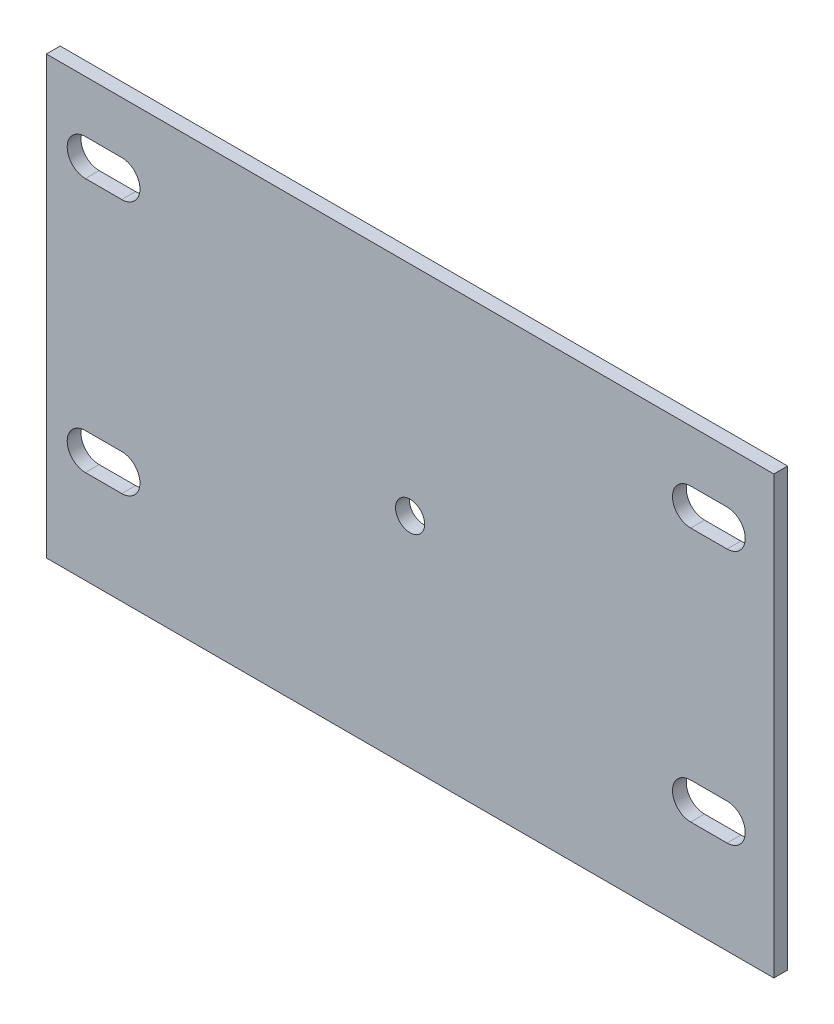
ISO-10303-21;
HEADER;
FILE_DESCRIPTION(('STEP AP214'),'2;1');
FILE_NAME('part.step','',(''),(''),'','','');
FILE_SCHEMA(('AUTOMOTIVE_DESIGN { 1 0 10303 214 1 1 1 1 }'));
ENDSEC;
DATA;
#1=APPLICATION_CONTEXT('core data for automotive mechanical design processes');
#2=APPLICATION_PROTOCOL_DEFINITION('international standard','automotive_design',2000,#1);
#3=PRODUCT_CONTEXT('',#1,'mechanical');
#4=PRODUCT('Part','Part','',(#3));
#5=PRODUCT_RELATED_PRODUCT_CATEGORY('part','',(#4));
#6=PRODUCT_DEFINITION_FORMATION('','',#4);
#7=PRODUCT_DEFINITION_CONTEXT('part definition',#1,'design');
#8=PRODUCT_DEFINITION('design','',#6,#7);
#9=PRODUCT_DEFINITION_SHAPE('','',#8);
#10=(LENGTH_UNIT() NAMED_UNIT(*) SI_UNIT(.MILLI.,.METRE.));
#11=(NAMED_UNIT(*) PLANE_ANGLE_UNIT() SI_UNIT($,.RADIAN.));
#12=(NAMED_UNIT(*) SI_UNIT($,.STERADIAN.) SOLID_ANGLE_UNIT());
#13=UNCERTAINTY_MEASURE_WITH_UNIT(LENGTH_MEASURE(1.E-05),#10,'distance_accuracy_value','');
#14=(GEOMETRIC_REPRESENTATION_CONTEXT(3) GLOBAL_UNCERTAINTY_ASSIGNED_CONTEXT((#13)) GLOBAL_UNIT_ASSIGNED_CONTEXT((#10,
#11,#12)) REPRESENTATION_CONTEXT('',''));
#15=CARTESIAN_POINT('',(0.,0.,0.));
#16=DIRECTION('',(0.,0.,1.));
#17=DIRECTION('',(1.,0.,0.));
#18=AXIS2_PLACEMENT_3D('',#15,#16,#17);
#19=CARTESIAN_POINT('',(-66.0086980920406,33.0866668623942,-1.89738));
#20=DIRECTION('',(-1.,0.,0.));
#21=DIRECTION('',(0.,0.,1.));
#22=AXIS2_PLACEMENT_3D('',#19,#20,#21);
#23=PLANE('',#22);
#24=DIRECTION('',(0.,-1.,0.));
#25=VECTOR('',#24,1.);
#26=CARTESIAN_POINT('',(-66.0086980920406,33.0866668623942,0.));
#27=LINE('',#26,#25);
#28=CARTESIAN_POINT('',(-66.0086980920406,33.0866668623942,0.));
#29=VERTEX_POINT('',#28);
#30=CARTESIAN_POINT('',(-66.0086980920406,-26.9133331376058,0.));
#31=VERTEX_POINT('',#30);
#32=EDGE_CURVE('E307',#29,#31,#27,.T.);
#33=ORIENTED_EDGE('',*,*,#32,.F.);
#34=DIRECTION('',(0.,0.,1.));
#35=VECTOR('',#34,1.);
#36=CARTESIAN_POINT('',(-66.0086980920406,33.0866668623942,-1.89738));
#37=LINE('',#36,#35);
#38=CARTESIAN_POINT('',(-66.0086980920406,33.0866668623942,-1.89738));
#39=VERTEX_POINT('',#38);
#40=EDGE_CURVE('E11',#39,#29,#37,.T.);
#41=ORIENTED_EDGE('',*,*,#40,.F.);
#42=DIRECTION('',(0.,-1.,0.));
#43=VECTOR('',#42,1.);
#44=CARTESIAN_POINT('',(-66.0086980920406,33.0866668623942,-1.89738));
#45=LINE('',#44,#43);
#46=CARTESIAN_POINT('',(-66.0086980920406,-26.9133331376058,-1.89738));
#47=VERTEX_POINT('',#46);
#48=EDGE_CURVE('E308',#39,#47,#45,.T.);
#49=ORIENTED_EDGE('',*,*,#48,.T.);
#50=DIRECTION('',(0.,0.,1.));
#51=VECTOR('',#50,1.);
#52=CARTESIAN_POINT('',(-66.0086980920406,-26.9133331376058,-1.89738));
#53=LINE('',#52,#51);
#54=EDGE_CURVE('E40',#47,#31,#53,.T.);
#55=ORIENTED_EDGE('',*,*,#54,.T.);
#56=EDGE_LOOP('',(#33,#41,#49,#55));
#57=FACE_BOUND('',#56,.T.);
#58=ADVANCED_FACE('F37',(#57),#23,.T.);
#59=CARTESIAN_POINT('',(-66.0086980920406,33.0866668623942,-1.89738));
#60=DIRECTION('',(0.,1.,0.));
#61=DIRECTION('',(0.,0.,1.));
#62=AXIS2_PLACEMENT_3D('',#59,#60,#61);
#63=PLANE('',#62);
#64=DIRECTION('',(-1.,0.,0.));
#65=VECTOR('',#64,1.);
#66=CARTESIAN_POINT('',(-66.0086980920406,33.0866668623942,0.));
#67=LINE('',#66,#65);
#68=CARTESIAN_POINT('',(33.9913019079594,33.0866668623942,0.));
#69=VERTEX_POINT('',#68);
#70=EDGE_CURVE('E312',#69,#29,#67,.T.);
#71=ORIENTED_EDGE('',*,*,#70,.F.);
#72=DIRECTION('',(0.,0.,1.));
#73=VECTOR('',#72,1.);
#74=CARTESIAN_POINT('',(33.9913019079594,33.0866668623942,-1.89738));
#75=LINE('',#74,#73);
#76=CARTESIAN_POINT('',(33.9913019079594,33.0866668623942,-1.89738));
#77=VERTEX_POINT('',#76);
#78=EDGE_CURVE('E45',#77,#69,#75,.T.);
#79=ORIENTED_EDGE('',*,*,#78,.F.);
#80=DIRECTION('',(-1.,0.,0.));
#81=VECTOR('',#80,1.);
#82=CARTESIAN_POINT('',(-66.0086980920406,33.0866668623942,-1.89738));
#83=LINE('',#82,#81);
#84=EDGE_CURVE('E318',#77,#39,#83,.T.);
#85=ORIENTED_EDGE('',*,*,#84,.T.);
#86=ORIENTED_EDGE('',*,*,#40,.T.);
#87=EDGE_LOOP('',(#71,#79,#85,#86));
#88=FACE_BOUND('',#87,.T.);
#89=ADVANCED_FACE('F343',(#88),#63,.T.);
#90=CARTESIAN_POINT('',(33.9913019079594,33.0866668623942,-1.89738));
#91=DIRECTION('',(1.,0.,0.));
#92=DIRECTION('',(0.,0.,-1.));
#93=AXIS2_PLACEMENT_3D('',#90,#91,#92);
#94=PLANE('',#93);
#95=DIRECTION('',(0.,1.,0.));
#96=VECTOR('',#95,1.);
#97=CARTESIAN_POINT('',(33.9913019079594,33.0866668623942,0.));
#98=LINE('',#97,#96);
#99=CARTESIAN_POINT('',(33.9913019079594,-26.9133331376058,0.));
#100=VERTEX_POINT('',#99);
#101=EDGE_CURVE('E326',#100,#69,#98,.T.);
#102=ORIENTED_EDGE('',*,*,#101,.F.);
#103=DIRECTION('',(0.,0.,1.));
#104=VECTOR('',#103,1.);
#105=CARTESIAN_POINT('',(33.9913019079594,-26.9133331376058,-1.89738));
#106=LINE('',#105,#104);
#107=CARTESIAN_POINT('',(33.9913019079594,-26.9133331376058,-1.89738));
#108=VERTEX_POINT('',#107);
#109=EDGE_CURVE('E331',#108,#100,#106,.T.);
#110=ORIENTED_EDGE('',*,*,#109,.F.);
#111=DIRECTION('',(0.,1.,0.));
#112=VECTOR('',#111,1.);
#113=CARTESIAN_POINT('',(33.9913019079594,33.0866668623942,-1.89738));
#114=LINE('',#113,#112);
#115=EDGE_CURVE('E315',#108,#77,#114,.T.);
#116=ORIENTED_EDGE('',*,*,#115,.T.);
#117=ORIENTED_EDGE('',*,*,#78,.T.);
#118=EDGE_LOOP('',(#102,#110,#116,#117));
#119=FACE_BOUND('',#118,.T.);
#120=ADVANCED_FACE('F349',(#119),#94,.T.);
#121=CARTESIAN_POINT('',(-66.0086980920406,-26.9133331376058,-1.89738));
#122=DIRECTION('',(0.,-1.,0.));
#123=DIRECTION('',(0.,0.,-1.));
#124=AXIS2_PLACEMENT_3D('',#121,#122,#123);
#125=PLANE('',#124);
#126=DIRECTION('',(1.,0.,0.));
#127=VECTOR('',#126,1.);
#128=CARTESIAN_POINT('',(-66.0086980920406,-26.9133331376058,0.));
#129=LINE('',#128,#127);
#130=EDGE_CURVE('E323',#31,#100,#129,.T.);
#131=ORIENTED_EDGE('',*,*,#130,.F.);
#132=ORIENTED_EDGE('',*,*,#54,.F.);
#133=DIRECTION('',(1.,0.,0.));
#134=VECTOR('',#133,1.);
#135=CARTESIAN_POINT('',(-66.0086980920406,-26.9133331376058,-1.89738));
#136=LINE('',#135,#134);
#137=EDGE_CURVE('E311',#47,#108,#136,.T.);
#138=ORIENTED_EDGE('',*,*,#137,.T.);
#139=ORIENTED_EDGE('',*,*,#109,.T.);
#140=EDGE_LOOP('',(#131,#132,#138,#139));
#141=FACE_BOUND('',#140,.T.);
#142=ADVANCED_FACE('F339',(#141),#125,.T.);
#143=CARTESIAN_POINT('',(0.,0.,-1.89738));
#144=DIRECTION('',(0.,0.,1.));
#145=DIRECTION('',(1.,0.,0.));
#146=AXIS2_PLACEMENT_3D('',#143,#144,#145);
#147=PLANE('',#146);
#148=CARTESIAN_POINT('',(-16.0086980920406,3.08666686239417,-1.89738));
#149=DIRECTION('',(0.,0.,1.));
#150=DIRECTION('',(1.,0.,0.));
#151=AXIS2_PLACEMENT_3D('',#148,#149,#150);
#152=CIRCLE('',#151,2.);
#153=CARTESIAN_POINT('',(-14.0086980920406,3.08666686239417,-1.89738));
#154=VERTEX_POINT('',#153);
#155=EDGE_CURVE('E615',#154,#154,#152,.T.);
#156=ORIENTED_EDGE('',*,*,#155,.T.);
#157=EDGE_LOOP('',(#156));
#158=FACE_BOUND('',#157,.T.);
#159=DIRECTION('',(1.,0.,0.));
#160=VECTOR('',#159,1.);
#161=CARTESIAN_POINT('',(0.,-14.0611849792509,-1.89738));
#162=LINE('',#161,#160);
#163=CARTESIAN_POINT('',(22.5608827371854,-14.0611849792509,-1.89738));
#164=VERTEX_POINT('',#163);
#165=CARTESIAN_POINT('',(27.5608827371854,-14.0611849792509,-1.89738));
#166=VERTEX_POINT('',#165);
#167=EDGE_CURVE('E205',#164,#166,#162,.T.);
#168=ORIENTED_EDGE('',*,*,#167,.T.);
#169=CARTESIAN_POINT('',(27.5608827371854,-11.5611849792509,-1.89738));
#170=DIRECTION('',(0.,0.,1.));
#171=DIRECTION('',(1.,0.,0.));
#172=AXIS2_PLACEMENT_3D('',#169,#170,#171);
#173=CIRCLE('',#172,2.5);
#174=CARTESIAN_POINT('',(27.5608827371854,-9.06118497925086,-1.89738));
#175=VERTEX_POINT('',#174);
#176=EDGE_CURVE('E208',#166,#175,#173,.T.);
#177=ORIENTED_EDGE('',*,*,#176,.T.);
#178=DIRECTION('',(-1.,0.,0.));
#179=VECTOR('',#178,1.);
#180=CARTESIAN_POINT('',(0.,-9.06118497925087,-1.89738));
#181=LINE('',#180,#179);
#182=CARTESIAN_POINT('',(22.5608827371854,-9.06118497925086,-1.89738));
#183=VERTEX_POINT('',#182);
#184=EDGE_CURVE('E200',#175,#183,#181,.T.);
#185=ORIENTED_EDGE('',*,*,#184,.T.);
#186=CARTESIAN_POINT('',(22.5608827371854,-11.5611849792509,-1.89738));
#187=DIRECTION('',(0.,0.,1.));
#188=DIRECTION('',(1.,0.,0.));
#189=AXIS2_PLACEMENT_3D('',#186,#187,#188);
#190=CIRCLE('',#189,2.5);
#191=EDGE_CURVE('E180',#183,#164,#190,.T.);
#192=ORIENTED_EDGE('',*,*,#191,.T.);
#193=EDGE_LOOP('',(#168,#177,#185,#192));
#194=FACE_BOUND('',#193,.T.);
#195=DIRECTION('',(1.,0.,0.));
#196=VECTOR('',#195,1.);
#197=CARTESIAN_POINT('',(0.,20.9388150207494,-1.89738));
#198=LINE('',#197,#196);
#199=CARTESIAN_POINT('',(22.5608827371854,20.9388150207494,-1.89738));
#200=VERTEX_POINT('',#199);
#201=CARTESIAN_POINT('',(27.5608827371854,20.9388150207494,-1.89738));
#202=VERTEX_POINT('',#201);
#203=EDGE_CURVE('E237',#200,#202,#198,.T.);
#204=ORIENTED_EDGE('',*,*,#203,.T.);
#205=CARTESIAN_POINT('',(27.5608827371854,23.4388150207494,-1.89738));
#206=DIRECTION('',(0.,0.,1.));
#207=DIRECTION('',(1.,0.,0.));
#208=AXIS2_PLACEMENT_3D('',#205,#206,#207);
#209=CIRCLE('',#208,2.5);
#210=CARTESIAN_POINT('',(27.5608827371854,25.9388150207494,-1.89738));
#211=VERTEX_POINT('',#210);
#212=EDGE_CURVE('E240',#202,#211,#209,.T.);
#213=ORIENTED_EDGE('',*,*,#212,.T.);
#214=DIRECTION('',(-1.,0.,0.));
#215=VECTOR('',#214,1.);
#216=CARTESIAN_POINT('',(0.,25.9388150207494,-1.89738));
#217=LINE('',#216,#215);
#218=CARTESIAN_POINT('',(22.5608827371854,25.9388150207494,-1.89738));
#219=VERTEX_POINT('',#218);
#220=EDGE_CURVE('E225',#211,#219,#217,.T.);
#221=ORIENTED_EDGE('',*,*,#220,.T.);
#222=CARTESIAN_POINT('',(22.5608827371854,23.4388150207494,-1.89738));
#223=DIRECTION('',(0.,0.,1.));
#224=DIRECTION('',(1.,0.,0.));
#225=AXIS2_PLACEMENT_3D('',#222,#223,#224);
#226=CIRCLE('',#225,2.5);
#227=EDGE_CURVE('E234',#219,#200,#226,.T.);
#228=ORIENTED_EDGE('',*,*,#227,.T.);
#229=EDGE_LOOP('',(#204,#213,#221,#228));
#230=FACE_BOUND('',#229,.T.);
#231=DIRECTION('',(-1.,0.,0.));
#232=VECTOR('',#231,1.);
#233=CARTESIAN_POINT('',(0.,25.9388150207494,-1.89738));
#234=LINE('',#233,#232);
#235=CARTESIAN_POINT('',(-55.6443572628158,25.9388150207494,-1.89738));
#236=VERTEX_POINT('',#235);
#237=CARTESIAN_POINT('',(-60.6443572628158,25.9388150207494,-1.89738));
#238=VERTEX_POINT('',#237);
#239=EDGE_CURVE('E269',#236,#238,#234,.T.);
#240=ORIENTED_EDGE('',*,*,#239,.T.);
#241=CARTESIAN_POINT('',(-60.6443572628158,23.4388150207494,-1.89738));
#242=DIRECTION('',(0.,0.,1.));
#243=DIRECTION('',(1.,0.,0.));
#244=AXIS2_PLACEMENT_3D('',#241,#242,#243);
#245=CIRCLE('',#244,2.5);
#246=CARTESIAN_POINT('',(-60.6443572628158,20.9388150207494,-1.89738));
#247=VERTEX_POINT('',#246);
#248=EDGE_CURVE('E272',#238,#247,#245,.T.);
#249=ORIENTED_EDGE('',*,*,#248,.T.);
#250=DIRECTION('',(1.,0.,0.));
#251=VECTOR('',#250,1.);
#252=CARTESIAN_POINT('',(0.,20.9388150207494,-1.89738));
#253=LINE('',#252,#251);
#254=CARTESIAN_POINT('',(-55.6443572628158,20.9388150207494,-1.89738));
#255=VERTEX_POINT('',#254);
#256=EDGE_CURVE('E257',#247,#255,#253,.T.);
#257=ORIENTED_EDGE('',*,*,#256,.T.);
#258=CARTESIAN_POINT('',(-55.6443572628158,23.4388150207494,-1.89738));
#259=DIRECTION('',(0.,0.,1.));
#260=DIRECTION('',(1.,0.,0.));
#261=AXIS2_PLACEMENT_3D('',#258,#259,#260);
#262=CIRCLE('',#261,2.5);
#263=EDGE_CURVE('E266',#255,#236,#262,.T.);
#264=ORIENTED_EDGE('',*,*,#263,.T.);
#265=EDGE_LOOP('',(#240,#249,#257,#264));
#266=FACE_BOUND('',#265,.T.);
#267=DIRECTION('',(-1.,0.,0.));
#268=VECTOR('',#267,1.);
#269=CARTESIAN_POINT('',(0.,-9.06118497925084,-1.89738));
#270=LINE('',#269,#268);
#271=CARTESIAN_POINT('',(-55.6443572628158,-9.06118497925086,-1.89738));
#272=VERTEX_POINT('',#271);
#273=CARTESIAN_POINT('',(-60.6443572628158,-9.06118497925086,-1.89738));
#274=VERTEX_POINT('',#273);
#275=EDGE_CURVE('E301',#272,#274,#270,.T.);
#276=ORIENTED_EDGE('',*,*,#275,.T.);
#277=CARTESIAN_POINT('',(-60.6443572628158,-11.5611849792509,-1.89738));
#278=DIRECTION('',(0.,0.,1.));
#279=DIRECTION('',(1.,0.,0.));
#280=AXIS2_PLACEMENT_3D('',#277,#278,#279);
#281=CIRCLE('',#280,2.5);
#282=CARTESIAN_POINT('',(-60.6443572628158,-14.0611849792509,-1.89738));
#283=VERTEX_POINT('',#282);
#284=EDGE_CURVE('E304',#274,#283,#281,.T.);
#285=ORIENTED_EDGE('',*,*,#284,.T.);
#286=DIRECTION('',(1.,0.,0.));
#287=VECTOR('',#286,1.);
#288=CARTESIAN_POINT('',(0.,-14.0611849792508,-1.89738));
#289=LINE('',#288,#287);
#290=CARTESIAN_POINT('',(-55.6443572628158,-14.0611849792509,-1.89738));
#291=VERTEX_POINT('',#290);
#292=EDGE_CURVE('E289',#283,#291,#289,.T.);
#293=ORIENTED_EDGE('',*,*,#292,.T.);
#294=CARTESIAN_POINT('',(-55.6443572628158,-11.5611849792509,-1.89738));
#295=DIRECTION('',(0.,0.,1.));
#296=DIRECTION('',(1.,0.,0.));
#297=AXIS2_PLACEMENT_3D('',#294,#295,#296);
#298=CIRCLE('',#297,2.5);
#299=EDGE_CURVE('E298',#291,#272,#298,.T.);
#300=ORIENTED_EDGE('',*,*,#299,.T.);
#301=EDGE_LOOP('',(#276,#285,#293,#300));
#302=FACE_BOUND('',#301,.T.);
#303=ORIENTED_EDGE('',*,*,#48,.F.);
#304=ORIENTED_EDGE('',*,*,#84,.F.);
#305=ORIENTED_EDGE('',*,*,#115,.F.);
#306=ORIENTED_EDGE('',*,*,#137,.F.);
#307=EDGE_LOOP('',(#303,#304,#305,#306));
#308=FACE_BOUND('',#307,.T.);
#309=ADVANCED_FACE('F346',(#158,#194,#230,#266,#302,#308),#147,.F.);
#310=CARTESIAN_POINT('',(0.,0.,0.));
#311=DIRECTION('',(0.,0.,1.));
#312=DIRECTION('',(1.,0.,0.));
#313=AXIS2_PLACEMENT_3D('',#310,#311,#312);
#314=PLANE('',#313);
#315=CARTESIAN_POINT('',(-16.0086980920406,3.08666686239417,0.));
#316=DIRECTION('',(0.,0.,1.));
#317=DIRECTION('',(1.,0.,0.));
#318=AXIS2_PLACEMENT_3D('',#315,#316,#317);
#319=CIRCLE('',#318,2.);
#320=CARTESIAN_POINT('',(-14.0086980920406,3.08666686239417,0.));
#321=VERTEX_POINT('',#320);
#322=EDGE_CURVE('E612',#321,#321,#319,.T.);
#323=ORIENTED_EDGE('',*,*,#322,.F.);
#324=EDGE_LOOP('',(#323));
#325=FACE_BOUND('',#324,.T.);
#326=CARTESIAN_POINT('',(27.5608827371854,-11.5611849792509,0.));
#327=DIRECTION('',(0.,0.,1.));
#328=DIRECTION('',(1.,0.,0.));
#329=AXIS2_PLACEMENT_3D('',#326,#327,#328);
#330=CIRCLE('',#329,2.5);
#331=CARTESIAN_POINT('',(27.5608827371854,-14.0611849792509,0.));
#332=VERTEX_POINT('',#331);
#333=CARTESIAN_POINT('',(27.5608827371854,-9.06118497925086,0.));
#334=VERTEX_POINT('',#333);
#335=EDGE_CURVE('E61',#332,#334,#330,.T.);
#336=ORIENTED_EDGE('',*,*,#335,.F.);
#337=DIRECTION('',(1.,0.,0.));
#338=VECTOR('',#337,1.);
#339=CARTESIAN_POINT('',(27.5608827371854,-14.0611849792509,0.));
#340=LINE('',#339,#338);
#341=CARTESIAN_POINT('',(22.5608827371854,-14.0611849792509,0.));
#342=VERTEX_POINT('',#341);
#343=EDGE_CURVE('E193',#342,#332,#340,.T.);
#344=ORIENTED_EDGE('',*,*,#343,.F.);
#345=CARTESIAN_POINT('',(22.5608827371854,-11.5611849792509,0.));
#346=DIRECTION('',(0.,0.,1.));
#347=DIRECTION('',(1.,0.,0.));
#348=AXIS2_PLACEMENT_3D('',#345,#346,#347);
#349=CIRCLE('',#348,2.5);
#350=CARTESIAN_POINT('',(22.5608827371854,-9.06118497925086,0.));
#351=VERTEX_POINT('',#350);
#352=EDGE_CURVE('E177',#351,#342,#349,.T.);
#353=ORIENTED_EDGE('',*,*,#352,.F.);
#354=DIRECTION('',(-1.,0.,0.));
#355=VECTOR('',#354,1.);
#356=CARTESIAN_POINT('',(27.5608827371854,-9.06118497925086,0.));
#357=LINE('',#356,#355);
#358=EDGE_CURVE('E186',#334,#351,#357,.T.);
#359=ORIENTED_EDGE('',*,*,#358,.F.);
#360=EDGE_LOOP('',(#336,#344,#353,#359));
#361=FACE_BOUND('',#360,.T.);
#362=CARTESIAN_POINT('',(27.5608827371854,23.4388150207494,0.));
#363=DIRECTION('',(0.,0.,1.));
#364=DIRECTION('',(1.,0.,0.));
#365=AXIS2_PLACEMENT_3D('',#362,#363,#364);
#366=CIRCLE('',#365,2.5);
#367=CARTESIAN_POINT('',(27.5608827371854,20.9388150207494,0.));
#368=VERTEX_POINT('',#367);
#369=CARTESIAN_POINT('',(27.5608827371854,25.9388150207494,0.));
#370=VERTEX_POINT('',#369);
#371=EDGE_CURVE('E211',#368,#370,#366,.T.);
#372=ORIENTED_EDGE('',*,*,#371,.F.);
#373=DIRECTION('',(1.,0.,0.));
#374=VECTOR('',#373,1.);
#375=CARTESIAN_POINT('',(27.5608827371854,20.9388150207494,0.));
#376=LINE('',#375,#374);
#377=CARTESIAN_POINT('',(22.5608827371854,20.9388150207494,0.));
#378=VERTEX_POINT('',#377);
#379=EDGE_CURVE('E219',#378,#368,#376,.T.);
#380=ORIENTED_EDGE('',*,*,#379,.F.);
#381=CARTESIAN_POINT('',(22.5608827371854,23.4388150207494,0.));
#382=DIRECTION('',(0.,0.,1.));
#383=DIRECTION('',(1.,0.,0.));
#384=AXIS2_PLACEMENT_3D('',#381,#382,#383);
#385=CIRCLE('',#384,2.5);
#386=CARTESIAN_POINT('',(22.5608827371854,25.9388150207494,0.));
#387=VERTEX_POINT('',#386);
#388=EDGE_CURVE('E216',#387,#378,#385,.T.);
#389=ORIENTED_EDGE('',*,*,#388,.F.);
#390=DIRECTION('',(-1.,0.,0.));
#391=VECTOR('',#390,1.);
#392=CARTESIAN_POINT('',(27.5608827371854,25.9388150207494,0.));
#393=LINE('',#392,#391);
#394=EDGE_CURVE('E213',#370,#387,#393,.T.);
#395=ORIENTED_EDGE('',*,*,#394,.F.);
#396=EDGE_LOOP('',(#372,#380,#389,#395));
#397=FACE_BOUND('',#396,.T.);
#398=CARTESIAN_POINT('',(-60.6443572628158,23.4388150207494,0.));
#399=DIRECTION('',(0.,0.,1.));
#400=DIRECTION('',(1.,0.,0.));
#401=AXIS2_PLACEMENT_3D('',#398,#399,#400);
#402=CIRCLE('',#401,2.5);
#403=CARTESIAN_POINT('',(-60.6443572628158,25.9388150207494,0.));
#404=VERTEX_POINT('',#403);
#405=CARTESIAN_POINT('',(-60.6443572628158,20.9388150207494,0.));
#406=VERTEX_POINT('',#405);
#407=EDGE_CURVE('E243',#404,#406,#402,.T.);
#408=ORIENTED_EDGE('',*,*,#407,.F.);
#409=DIRECTION('',(-1.,0.,0.));
#410=VECTOR('',#409,1.);
#411=CARTESIAN_POINT('',(-60.6443572628158,25.9388150207494,0.));
#412=LINE('',#411,#410);
#413=CARTESIAN_POINT('',(-55.6443572628158,25.9388150207494,0.));
#414=VERTEX_POINT('',#413);
#415=EDGE_CURVE('E251',#414,#404,#412,.T.);
#416=ORIENTED_EDGE('',*,*,#415,.F.);
#417=CARTESIAN_POINT('',(-55.6443572628158,23.4388150207494,0.));
#418=DIRECTION('',(0.,0.,1.));
#419=DIRECTION('',(1.,0.,0.));
#420=AXIS2_PLACEMENT_3D('',#417,#418,#419);
#421=CIRCLE('',#420,2.5);
#422=CARTESIAN_POINT('',(-55.6443572628158,20.9388150207494,0.));
#423=VERTEX_POINT('',#422);
#424=EDGE_CURVE('E248',#423,#414,#421,.T.);
#425=ORIENTED_EDGE('',*,*,#424,.F.);
#426=DIRECTION('',(1.,0.,0.));
#427=VECTOR('',#426,1.);
#428=CARTESIAN_POINT('',(-60.6443572628158,20.9388150207494,0.));
#429=LINE('',#428,#427);
#430=EDGE_CURVE('E245',#406,#423,#429,.T.);
#431=ORIENTED_EDGE('',*,*,#430,.F.);
#432=EDGE_LOOP('',(#408,#416,#425,#431));
#433=FACE_BOUND('',#432,.T.);
#434=CARTESIAN_POINT('',(-60.6443572628158,-11.5611849792509,0.));
#435=DIRECTION('',(0.,0.,1.));
#436=DIRECTION('',(1.,0.,0.));
#437=AXIS2_PLACEMENT_3D('',#434,#435,#436);
#438=CIRCLE('',#437,2.5);
#439=CARTESIAN_POINT('',(-60.6443572628158,-9.06118497925086,0.));
#440=VERTEX_POINT('',#439);
#441=CARTESIAN_POINT('',(-60.6443572628158,-14.0611849792509,0.));
#442=VERTEX_POINT('',#441);
#443=EDGE_CURVE('E275',#440,#442,#438,.T.);
#444=ORIENTED_EDGE('',*,*,#443,.F.);
#445=DIRECTION('',(-1.,0.,0.));
#446=VECTOR('',#445,1.);
#447=CARTESIAN_POINT('',(-60.6443572628158,-9.06118497925086,0.));
#448=LINE('',#447,#446);
#449=CARTESIAN_POINT('',(-55.6443572628158,-9.06118497925086,0.));
#450=VERTEX_POINT('',#449);
#451=EDGE_CURVE('E283',#450,#440,#448,.T.);
#452=ORIENTED_EDGE('',*,*,#451,.F.);
#453=CARTESIAN_POINT('',(-55.6443572628158,-11.5611849792509,0.));
#454=DIRECTION('',(0.,0.,1.));
#455=DIRECTION('',(1.,0.,0.));
#456=AXIS2_PLACEMENT_3D('',#453,#454,#455);
#457=CIRCLE('',#456,2.5);
#458=CARTESIAN_POINT('',(-55.6443572628158,-14.0611849792509,0.));
#459=VERTEX_POINT('',#458);
#460=EDGE_CURVE('E280',#459,#450,#457,.T.);
#461=ORIENTED_EDGE('',*,*,#460,.F.);
#462=DIRECTION('',(1.,0.,0.));
#463=VECTOR('',#462,1.);
#464=CARTESIAN_POINT('',(-60.6443572628158,-14.0611849792509,0.));
#465=LINE('',#464,#463);
#466=EDGE_CURVE('E277',#442,#459,#465,.T.);
#467=ORIENTED_EDGE('',*,*,#466,.F.);
#468=EDGE_LOOP('',(#444,#452,#461,#467));
#469=FACE_BOUND('',#468,.T.);
#470=ORIENTED_EDGE('',*,*,#32,.T.);
#471=ORIENTED_EDGE('',*,*,#130,.T.);
#472=ORIENTED_EDGE('',*,*,#101,.T.);
#473=ORIENTED_EDGE('',*,*,#70,.T.);
#474=EDGE_LOOP('',(#470,#471,#472,#473));
#475=FACE_BOUND('',#474,.T.);
#476=ADVANCED_FACE('F190',(#325,#361,#397,#433,#469,#475),#314,.T.);
#477=CARTESIAN_POINT('',(-60.6443572628158,-11.5611849792509,-2.));
#478=DIRECTION('',(0.,0.,1.));
#479=DIRECTION('',(1.,0.,0.));
#480=AXIS2_PLACEMENT_3D('',#477,#478,#479);
#481=CYLINDRICAL_SURFACE('',#480,2.5);
#482=DIRECTION('',(0.,0.,1.));
#483=VECTOR('',#482,1.);
#484=CARTESIAN_POINT('',(-60.6443572628158,-9.06118497925086,-2.));
#485=LINE('',#484,#483);
#486=EDGE_CURVE('E287',#274,#440,#485,.T.);
#487=ORIENTED_EDGE('',*,*,#486,.T.);
#488=ORIENTED_EDGE('',*,*,#443,.T.);
#489=DIRECTION('',(0.,0.,1.));
#490=VECTOR('',#489,1.);
#491=CARTESIAN_POINT('',(-60.6443572628158,-14.0611849792509,-2.));
#492=LINE('',#491,#490);
#493=EDGE_CURVE('E286',#283,#442,#492,.T.);
#494=ORIENTED_EDGE('',*,*,#493,.F.);
#495=ORIENTED_EDGE('',*,*,#284,.F.);
#496=EDGE_LOOP('',(#487,#488,#494,#495));
#497=FACE_BOUND('',#496,.T.);
#498=ADVANCED_FACE('F396',(#497),#481,.F.);
#499=CARTESIAN_POINT('',(-60.6443572628158,-9.06118497925086,-2.));
#500=DIRECTION('',(0.,1.,0.));
#501=DIRECTION('',(-1.,0.,0.));
#502=AXIS2_PLACEMENT_3D('',#499,#500,#501);
#503=PLANE('',#502);
#504=DIRECTION('',(0.,0.,1.));
#505=VECTOR('',#504,1.);
#506=CARTESIAN_POINT('',(-55.6443572628158,-9.06118497925086,-2.));
#507=LINE('',#506,#505);
#508=EDGE_CURVE('E290',#272,#450,#507,.T.);
#509=ORIENTED_EDGE('',*,*,#508,.T.);
#510=ORIENTED_EDGE('',*,*,#451,.T.);
#511=ORIENTED_EDGE('',*,*,#486,.F.);
#512=ORIENTED_EDGE('',*,*,#275,.F.);
#513=EDGE_LOOP('',(#509,#510,#511,#512));
#514=FACE_BOUND('',#513,.T.);
#515=ADVANCED_FACE('F407',(#514),#503,.F.);
#516=CARTESIAN_POINT('',(-55.6443572628158,-11.5611849792509,-2.));
#517=DIRECTION('',(0.,0.,1.));
#518=DIRECTION('',(1.,0.,0.));
#519=AXIS2_PLACEMENT_3D('',#516,#517,#518);
#520=CYLINDRICAL_SURFACE('',#519,2.5);
#521=DIRECTION('',(0.,0.,1.));
#522=VECTOR('',#521,1.);
#523=CARTESIAN_POINT('',(-55.6443572628158,-14.0611849792509,-2.));
#524=LINE('',#523,#522);
#525=EDGE_CURVE('E292',#291,#459,#524,.T.);
#526=ORIENTED_EDGE('',*,*,#525,.T.);
#527=ORIENTED_EDGE('',*,*,#460,.T.);
#528=ORIENTED_EDGE('',*,*,#508,.F.);
#529=ORIENTED_EDGE('',*,*,#299,.F.);
#530=EDGE_LOOP('',(#526,#527,#528,#529));
#531=FACE_BOUND('',#530,.T.);
#532=ADVANCED_FACE('F418',(#531),#520,.F.);
#533=CARTESIAN_POINT('',(-60.6443572628158,-14.0611849792509,-2.));
#534=DIRECTION('',(0.,-1.,0.));
#535=DIRECTION('',(1.,0.,0.));
#536=AXIS2_PLACEMENT_3D('',#533,#534,#535);
#537=PLANE('',#536);
#538=ORIENTED_EDGE('',*,*,#493,.T.);
#539=ORIENTED_EDGE('',*,*,#466,.T.);
#540=ORIENTED_EDGE('',*,*,#525,.F.);
#541=ORIENTED_EDGE('',*,*,#292,.F.);
#542=EDGE_LOOP('',(#538,#539,#540,#541));
#543=FACE_BOUND('',#542,.T.);
#544=ADVANCED_FACE('F429',(#543),#537,.F.);
#545=CARTESIAN_POINT('',(-60.6443572628158,23.4388150207494,-2.));
#546=DIRECTION('',(0.,0.,1.));
#547=DIRECTION('',(1.,0.,0.));
#548=AXIS2_PLACEMENT_3D('',#545,#546,#547);
#549=CYLINDRICAL_SURFACE('',#548,2.5);
#550=DIRECTION('',(0.,0.,1.));
#551=VECTOR('',#550,1.);
#552=CARTESIAN_POINT('',(-60.6443572628158,25.9388150207494,-2.));
#553=LINE('',#552,#551);
#554=EDGE_CURVE('E255',#238,#404,#553,.T.);
#555=ORIENTED_EDGE('',*,*,#554,.T.);
#556=ORIENTED_EDGE('',*,*,#407,.T.);
#557=DIRECTION('',(0.,0.,1.));
#558=VECTOR('',#557,1.);
#559=CARTESIAN_POINT('',(-60.6443572628158,20.9388150207494,-2.));
#560=LINE('',#559,#558);
#561=EDGE_CURVE('E254',#247,#406,#560,.T.);
#562=ORIENTED_EDGE('',*,*,#561,.F.);
#563=ORIENTED_EDGE('',*,*,#248,.F.);
#564=EDGE_LOOP('',(#555,#556,#562,#563));
#565=FACE_BOUND('',#564,.T.);
#566=ADVANCED_FACE('F440',(#565),#549,.F.);
#567=CARTESIAN_POINT('',(-60.6443572628158,25.9388150207494,-2.));
#568=DIRECTION('',(0.,1.,0.));
#569=DIRECTION('',(0.,0.,1.));
#570=AXIS2_PLACEMENT_3D('',#567,#568,#569);
#571=PLANE('',#570);
#572=DIRECTION('',(0.,0.,1.));
#573=VECTOR('',#572,1.);
#574=CARTESIAN_POINT('',(-55.6443572628158,25.9388150207494,-2.));
#575=LINE('',#574,#573);
#576=EDGE_CURVE('E258',#236,#414,#575,.T.);
#577=ORIENTED_EDGE('',*,*,#576,.T.);
#578=ORIENTED_EDGE('',*,*,#415,.T.);
#579=ORIENTED_EDGE('',*,*,#554,.F.);
#580=ORIENTED_EDGE('',*,*,#239,.F.);
#581=EDGE_LOOP('',(#577,#578,#579,#580));
#582=FACE_BOUND('',#581,.T.);
#583=ADVANCED_FACE('F451',(#582),#571,.F.);
#584=CARTESIAN_POINT('',(-55.6443572628158,23.4388150207494,-2.));
#585=DIRECTION('',(0.,0.,1.));
#586=DIRECTION('',(1.,0.,0.));
#587=AXIS2_PLACEMENT_3D('',#584,#585,#586);
#588=CYLINDRICAL_SURFACE('',#587,2.5);
#589=DIRECTION('',(0.,0.,1.));
#590=VECTOR('',#589,1.);
#591=CARTESIAN_POINT('',(-55.6443572628158,20.9388150207494,-2.));
#592=LINE('',#591,#590);
#593=EDGE_CURVE('E260',#255,#423,#592,.T.);
#594=ORIENTED_EDGE('',*,*,#593,.T.);
#595=ORIENTED_EDGE('',*,*,#424,.T.);
#596=ORIENTED_EDGE('',*,*,#576,.F.);
#597=ORIENTED_EDGE('',*,*,#263,.F.);
#598=EDGE_LOOP('',(#594,#595,#596,#597));
#599=FACE_BOUND('',#598,.T.);
#600=ADVANCED_FACE('F462',(#599),#588,.F.);
#601=CARTESIAN_POINT('',(-60.6443572628158,20.9388150207494,-2.));
#602=DIRECTION('',(0.,-1.,0.));
#603=DIRECTION('',(0.,0.,-1.));
#604=AXIS2_PLACEMENT_3D('',#601,#602,#603);
#605=PLANE('',#604);
#606=ORIENTED_EDGE('',*,*,#561,.T.);
#607=ORIENTED_EDGE('',*,*,#430,.T.);
#608=ORIENTED_EDGE('',*,*,#593,.F.);
#609=ORIENTED_EDGE('',*,*,#256,.F.);
#610=EDGE_LOOP('',(#606,#607,#608,#609));
#611=FACE_BOUND('',#610,.T.);
#612=ADVANCED_FACE('F473',(#611),#605,.F.);
#613=CARTESIAN_POINT('',(27.5608827371854,23.4388150207494,-2.));
#614=DIRECTION('',(0.,0.,1.));
#615=DIRECTION('',(1.,0.,0.));
#616=AXIS2_PLACEMENT_3D('',#613,#614,#615);
#617=CYLINDRICAL_SURFACE('',#616,2.5);
#618=DIRECTION('',(0.,0.,1.));
#619=VECTOR('',#618,1.);
#620=CARTESIAN_POINT('',(27.5608827371854,20.9388150207494,-2.));
#621=LINE('',#620,#619);
#622=EDGE_CURVE('E223',#202,#368,#621,.T.);
#623=ORIENTED_EDGE('',*,*,#622,.T.);
#624=ORIENTED_EDGE('',*,*,#371,.T.);
#625=DIRECTION('',(0.,0.,1.));
#626=VECTOR('',#625,1.);
#627=CARTESIAN_POINT('',(27.5608827371854,25.9388150207494,-2.));
#628=LINE('',#627,#626);
#629=EDGE_CURVE('E222',#211,#370,#628,.T.);
#630=ORIENTED_EDGE('',*,*,#629,.F.);
#631=ORIENTED_EDGE('',*,*,#212,.F.);
#632=EDGE_LOOP('',(#623,#624,#630,#631));
#633=FACE_BOUND('',#632,.T.);
#634=ADVANCED_FACE('F484',(#633),#617,.F.);
#635=CARTESIAN_POINT('',(27.5608827371854,20.9388150207494,-2.));
#636=DIRECTION('',(0.,-1.,0.));
#637=DIRECTION('',(0.,0.,-1.));
#638=AXIS2_PLACEMENT_3D('',#635,#636,#637);
#639=PLANE('',#638);
#640=DIRECTION('',(0.,0.,1.));
#641=VECTOR('',#640,1.);
#642=CARTESIAN_POINT('',(22.5608827371854,20.9388150207494,-2.));
#643=LINE('',#642,#641);
#644=EDGE_CURVE('E226',#200,#378,#643,.T.);
#645=ORIENTED_EDGE('',*,*,#644,.T.);
#646=ORIENTED_EDGE('',*,*,#379,.T.);
#647=ORIENTED_EDGE('',*,*,#622,.F.);
#648=ORIENTED_EDGE('',*,*,#203,.F.);
#649=EDGE_LOOP('',(#645,#646,#647,#648));
#650=FACE_BOUND('',#649,.T.);
#651=ADVANCED_FACE('F495',(#650),#639,.F.);
#652=CARTESIAN_POINT('',(22.5608827371854,23.4388150207494,-2.));
#653=DIRECTION('',(0.,0.,1.));
#654=DIRECTION('',(1.,0.,0.));
#655=AXIS2_PLACEMENT_3D('',#652,#653,#654);
#656=CYLINDRICAL_SURFACE('',#655,2.5);
#657=DIRECTION('',(0.,0.,1.));
#658=VECTOR('',#657,1.);
#659=CARTESIAN_POINT('',(22.5608827371854,25.9388150207494,-2.));
#660=LINE('',#659,#658);
#661=EDGE_CURVE('E228',#219,#387,#660,.T.);
#662=ORIENTED_EDGE('',*,*,#661,.T.);
#663=ORIENTED_EDGE('',*,*,#388,.T.);
#664=ORIENTED_EDGE('',*,*,#644,.F.);
#665=ORIENTED_EDGE('',*,*,#227,.F.);
#666=EDGE_LOOP('',(#662,#663,#664,#665));
#667=FACE_BOUND('',#666,.T.);
#668=ADVANCED_FACE('F506',(#667),#656,.F.);
#669=CARTESIAN_POINT('',(27.5608827371854,25.9388150207494,-2.));
#670=DIRECTION('',(0.,1.,0.));
#671=DIRECTION('',(0.,0.,1.));
#672=AXIS2_PLACEMENT_3D('',#669,#670,#671);
#673=PLANE('',#672);
#674=ORIENTED_EDGE('',*,*,#629,.T.);
#675=ORIENTED_EDGE('',*,*,#394,.T.);
#676=ORIENTED_EDGE('',*,*,#661,.F.);
#677=ORIENTED_EDGE('',*,*,#220,.F.);
#678=EDGE_LOOP('',(#674,#675,#676,#677));
#679=FACE_BOUND('',#678,.T.);
#680=ADVANCED_FACE('F517',(#679),#673,.F.);
#681=CARTESIAN_POINT('',(27.5608827371854,-11.5611849792509,-2.));
#682=DIRECTION('',(0.,0.,1.));
#683=DIRECTION('',(1.,0.,0.));
#684=AXIS2_PLACEMENT_3D('',#681,#682,#683);
#685=CYLINDRICAL_SURFACE('',#684,2.5);
#686=DIRECTION('',(0.,0.,1.));
#687=VECTOR('',#686,1.);
#688=CARTESIAN_POINT('',(27.5608827371854,-14.0611849792509,-2.));
#689=LINE('',#688,#687);
#690=EDGE_CURVE('E198',#166,#332,#689,.T.);
#691=ORIENTED_EDGE('',*,*,#690,.T.);
#692=ORIENTED_EDGE('',*,*,#335,.T.);
#693=DIRECTION('',(0.,0.,1.));
#694=VECTOR('',#693,1.);
#695=CARTESIAN_POINT('',(27.5608827371854,-9.06118497925086,-2.));
#696=LINE('',#695,#694);
#697=EDGE_CURVE('E183',#175,#334,#696,.T.);
#698=ORIENTED_EDGE('',*,*,#697,.F.);
#699=ORIENTED_EDGE('',*,*,#176,.F.);
#700=EDGE_LOOP('',(#691,#692,#698,#699));
#701=FACE_BOUND('',#700,.T.);
#702=ADVANCED_FACE('F528',(#701),#685,.F.);
#703=CARTESIAN_POINT('',(27.5608827371854,-14.0611849792509,-2.));
#704=DIRECTION('',(0.,-1.,0.));
#705=DIRECTION('',(1.,0.,0.));
#706=AXIS2_PLACEMENT_3D('',#703,#704,#705);
#707=PLANE('',#706);
#708=DIRECTION('',(0.,0.,1.));
#709=VECTOR('',#708,1.);
#710=CARTESIAN_POINT('',(22.5608827371854,-14.0611849792509,-2.));
#711=LINE('',#710,#709);
#712=EDGE_CURVE('E182',#164,#342,#711,.T.);
#713=ORIENTED_EDGE('',*,*,#712,.T.);
#714=ORIENTED_EDGE('',*,*,#343,.T.);
#715=ORIENTED_EDGE('',*,*,#690,.F.);
#716=ORIENTED_EDGE('',*,*,#167,.F.);
#717=EDGE_LOOP('',(#713,#714,#715,#716));
#718=FACE_BOUND('',#717,.T.);
#719=ADVANCED_FACE('F539',(#718),#707,.F.);
#720=CARTESIAN_POINT('',(22.5608827371854,-11.5611849792509,-2.));
#721=DIRECTION('',(0.,0.,1.));
#722=DIRECTION('',(1.,0.,0.));
#723=AXIS2_PLACEMENT_3D('',#720,#721,#722);
#724=CYLINDRICAL_SURFACE('',#723,2.5);
#725=DIRECTION('',(0.,0.,1.));
#726=VECTOR('',#725,1.);
#727=CARTESIAN_POINT('',(22.5608827371854,-9.06118497925086,-2.));
#728=LINE('',#727,#726);
#729=EDGE_CURVE('E53',#183,#351,#728,.T.);
#730=ORIENTED_EDGE('',*,*,#729,.T.);
#731=ORIENTED_EDGE('',*,*,#352,.T.);
#732=ORIENTED_EDGE('',*,*,#712,.F.);
#733=ORIENTED_EDGE('',*,*,#191,.F.);
#734=EDGE_LOOP('',(#730,#731,#732,#733));
#735=FACE_BOUND('',#734,.T.);
#736=ADVANCED_FACE('F174',(#735),#724,.F.);
#737=CARTESIAN_POINT('',(27.5608827371854,-9.06118497925086,-2.));
#738=DIRECTION('',(0.,1.,0.));
#739=DIRECTION('',(-1.,0.,0.));
#740=AXIS2_PLACEMENT_3D('',#737,#738,#739);
#741=PLANE('',#740);
#742=ORIENTED_EDGE('',*,*,#697,.T.);
#743=ORIENTED_EDGE('',*,*,#358,.T.);
#744=ORIENTED_EDGE('',*,*,#729,.F.);
#745=ORIENTED_EDGE('',*,*,#184,.F.);
#746=EDGE_LOOP('',(#742,#743,#744,#745));
#747=FACE_BOUND('',#746,.T.);
#748=ADVANCED_FACE('F187',(#747),#741,.F.);
#749=CARTESIAN_POINT('',(-16.0086980920406,3.08666686239417,-2.));
#750=DIRECTION('',(0.,0.,1.));
#751=DIRECTION('',(1.,0.,0.));
#752=AXIS2_PLACEMENT_3D('',#749,#750,#751);
#753=CYLINDRICAL_SURFACE('',#752,2.);
#754=ORIENTED_EDGE('',*,*,#322,.T.);
#755=EDGE_LOOP('',(#754));
#756=FACE_BOUND('',#755,.T.);
#757=ORIENTED_EDGE('',*,*,#155,.F.);
#758=EDGE_LOOP('',(#757));
#759=FACE_BOUND('',#758,.T.);
#760=ADVANCED_FACE('F568',(#756,#759),#753,.F.);
#761=CLOSED_SHELL('',(#58,#89,#120,#142,#309,#476,#498,#515,#532,#544,#566,#583,#600,#612,#634,
#651,#668,#680,#702,#719,#736,#748,#760));
#762=MANIFOLD_SOLID_BREP('B2',#761);
#763=ADVANCED_BREP_SHAPE_REPRESENTATION('',(#18,#762),#14);
#764=SHAPE_DEFINITION_REPRESENTATION(#9,#763);
ENDSEC;
END-ISO-10303-21;
